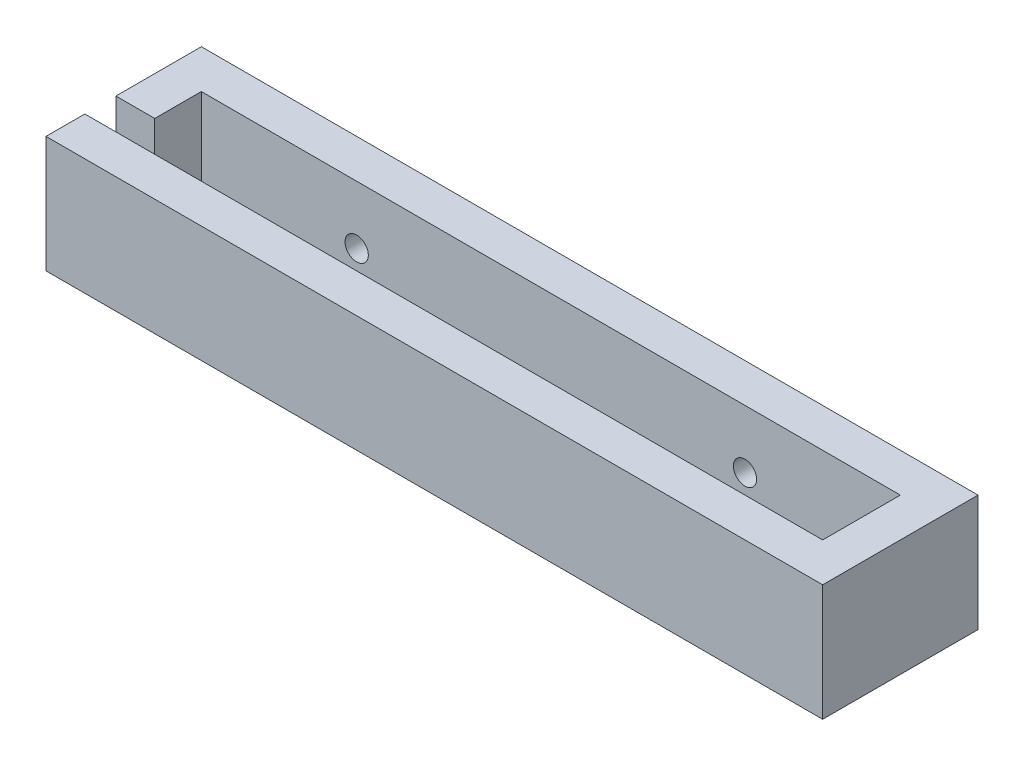
ISO-10303-21;
HEADER;
FILE_DESCRIPTION(('STEP AP214'),'2;1');
FILE_NAME('part.step','',(''),(''),'','','');
FILE_SCHEMA(('AUTOMOTIVE_DESIGN { 1 0 10303 214 1 1 1 1 }'));
ENDSEC;
DATA;
#1=APPLICATION_CONTEXT('core data for automotive mechanical design processes');
#2=APPLICATION_PROTOCOL_DEFINITION('international standard','automotive_design',2000,#1);
#3=PRODUCT_CONTEXT('',#1,'mechanical');
#4=PRODUCT('Part','Part','',(#3));
#5=PRODUCT_RELATED_PRODUCT_CATEGORY('part','',(#4));
#6=PRODUCT_DEFINITION_FORMATION('','',#4);
#7=PRODUCT_DEFINITION_CONTEXT('part definition',#1,'design');
#8=PRODUCT_DEFINITION('design','',#6,#7);
#9=PRODUCT_DEFINITION_SHAPE('','',#8);
#10=(LENGTH_UNIT() NAMED_UNIT(*) SI_UNIT(.MILLI.,.METRE.));
#11=(NAMED_UNIT(*) PLANE_ANGLE_UNIT() SI_UNIT($,.RADIAN.));
#12=(NAMED_UNIT(*) SI_UNIT($,.STERADIAN.) SOLID_ANGLE_UNIT());
#13=UNCERTAINTY_MEASURE_WITH_UNIT(LENGTH_MEASURE(1.E-05),#10,'distance_accuracy_value','');
#14=(GEOMETRIC_REPRESENTATION_CONTEXT(3) GLOBAL_UNCERTAINTY_ASSIGNED_CONTEXT((#13)) GLOBAL_UNIT_ASSIGNED_CONTEXT((#10,
#11,#12)) REPRESENTATION_CONTEXT('',''));
#15=CARTESIAN_POINT('',(0.,0.,0.));
#16=DIRECTION('',(0.,0.,1.));
#17=DIRECTION('',(1.,0.,0.));
#18=AXIS2_PLACEMENT_3D('',#15,#16,#17);
#19=CARTESIAN_POINT('',(-23.2792792792793,15.,-5.68018018018018));
#20=DIRECTION('',(1.,0.,0.));
#21=DIRECTION('',(0.,0.,-1.));
#22=AXIS2_PLACEMENT_3D('',#19,#20,#21);
#23=PLANE('',#22);
#24=DIRECTION('',(0.,0.,1.));
#25=VECTOR('',#24,1.);
#26=CARTESIAN_POINT('',(-23.2792792792793,15.,-5.68018018018018));
#27=LINE('',#26,#25);
#28=CARTESIAN_POINT('',(-23.2792792792793,15.,9.31981981981982));
#29=VERTEX_POINT('',#28);
#30=CARTESIAN_POINT('',(-23.2792792792793,15.,14.3198198198198));
#31=VERTEX_POINT('',#30);
#32=EDGE_CURVE('E80',#29,#31,#27,.T.);
#33=ORIENTED_EDGE('',*,*,#32,.F.);
#34=DIRECTION('',(0.,1.,0.));
#35=VECTOR('',#34,1.);
#36=CARTESIAN_POINT('',(-23.2792792792793,5.,9.31981981981982));
#37=LINE('',#36,#35);
#38=CARTESIAN_POINT('',(-23.2792792792793,5.,9.31981981981982));
#39=VERTEX_POINT('',#38);
#40=EDGE_CURVE('E161',#39,#29,#37,.T.);
#41=ORIENTED_EDGE('',*,*,#40,.F.);
#42=DIRECTION('',(0.,0.,1.));
#43=VECTOR('',#42,1.);
#44=CARTESIAN_POINT('',(-23.2792792792793,5.,9.31981981981982));
#45=LINE('',#44,#43);
#46=CARTESIAN_POINT('',(-23.2792792792793,5.,5.31981981981982));
#47=VERTEX_POINT('',#46);
#48=EDGE_CURVE('E129',#47,#39,#45,.T.);
#49=ORIENTED_EDGE('',*,*,#48,.F.);
#50=DIRECTION('',(0.,1.,0.));
#51=VECTOR('',#50,1.);
#52=CARTESIAN_POINT('',(-23.2792792792793,5.,5.31981981981982));
#53=LINE('',#52,#51);
#54=CARTESIAN_POINT('',(-23.2792792792793,15.,5.31981981981982));
#55=VERTEX_POINT('',#54);
#56=EDGE_CURVE('E124',#47,#55,#53,.T.);
#57=ORIENTED_EDGE('',*,*,#56,.T.);
#58=CARTESIAN_POINT('',(-23.2792792792793,15.,-5.68018018018018));
#59=VERTEX_POINT('',#58);
#60=EDGE_CURVE('E172',#59,#55,#27,.T.);
#61=ORIENTED_EDGE('',*,*,#60,.F.);
#62=DIRECTION('',(0.,-1.,0.));
#63=VECTOR('',#62,1.);
#64=CARTESIAN_POINT('',(-23.2792792792793,15.,-5.68018018018018));
#65=LINE('',#64,#63);
#66=CARTESIAN_POINT('',(-23.2792792792793,0.,-5.68018018018018));
#67=VERTEX_POINT('',#66);
#68=EDGE_CURVE('E179',#59,#67,#65,.T.);
#69=ORIENTED_EDGE('',*,*,#68,.T.);
#70=DIRECTION('',(0.,0.,1.));
#71=VECTOR('',#70,1.);
#72=CARTESIAN_POINT('',(-23.2792792792793,0.,-5.68018018018018));
#73=LINE('',#72,#71);
#74=CARTESIAN_POINT('',(-23.2792792792793,0.,14.3198198198198));
#75=VERTEX_POINT('',#74);
#76=EDGE_CURVE('E168',#67,#75,#73,.T.);
#77=ORIENTED_EDGE('',*,*,#76,.T.);
#78=DIRECTION('',(0.,-1.,0.));
#79=VECTOR('',#78,1.);
#80=CARTESIAN_POINT('',(-23.2792792792793,15.,14.3198198198198));
#81=LINE('',#80,#79);
#82=EDGE_CURVE('E11',#31,#75,#81,.T.);
#83=ORIENTED_EDGE('',*,*,#82,.F.);
#84=EDGE_LOOP('',(#33,#41,#49,#57,#61,#69,#77,#83));
#85=FACE_BOUND('',#84,.T.);
#86=ADVANCED_FACE('F33',(#85),#23,.F.);
#87=CARTESIAN_POINT('',(-23.2792792792793,15.,14.3198198198198));
#88=DIRECTION('',(0.,0.,-1.));
#89=DIRECTION('',(-1.,0.,0.));
#90=AXIS2_PLACEMENT_3D('',#87,#88,#89);
#91=PLANE('',#90);
#92=DIRECTION('',(1.,0.,0.));
#93=VECTOR('',#92,1.);
#94=CARTESIAN_POINT('',(-23.2792792792793,0.,14.3198198198198));
#95=LINE('',#94,#93);
#96=CARTESIAN_POINT('',(76.7207207207207,0.,14.3198198198198));
#97=VERTEX_POINT('',#96);
#98=EDGE_CURVE('E182',#75,#97,#95,.T.);
#99=ORIENTED_EDGE('',*,*,#98,.T.);
#100=DIRECTION('',(0.,-1.,0.));
#101=VECTOR('',#100,1.);
#102=CARTESIAN_POINT('',(76.7207207207207,15.,14.3198198198198));
#103=LINE('',#102,#101);
#104=CARTESIAN_POINT('',(76.7207207207207,15.,14.3198198198198));
#105=VERTEX_POINT('',#104);
#106=EDGE_CURVE('E41',#105,#97,#103,.T.);
#107=ORIENTED_EDGE('',*,*,#106,.F.);
#108=DIRECTION('',(1.,0.,0.));
#109=VECTOR('',#108,1.);
#110=CARTESIAN_POINT('',(-23.2792792792793,15.,14.3198198198198));
#111=LINE('',#110,#109);
#112=EDGE_CURVE('E174',#31,#105,#111,.T.);
#113=ORIENTED_EDGE('',*,*,#112,.F.);
#114=ORIENTED_EDGE('',*,*,#82,.T.);
#115=EDGE_LOOP('',(#99,#107,#113,#114));
#116=FACE_BOUND('',#115,.T.);
#117=ADVANCED_FACE('F210',(#116),#91,.F.);
#118=CARTESIAN_POINT('',(76.7207207207207,15.,-5.68018018018018));
#119=DIRECTION('',(-1.,0.,0.));
#120=DIRECTION('',(0.,0.,1.));
#121=AXIS2_PLACEMENT_3D('',#118,#119,#120);
#122=PLANE('',#121);
#123=DIRECTION('',(0.,0.,-1.));
#124=VECTOR('',#123,1.);
#125=CARTESIAN_POINT('',(76.7207207207207,0.,-5.68018018018018));
#126=LINE('',#125,#124);
#127=CARTESIAN_POINT('',(76.7207207207207,0.,-5.68018018018018));
#128=VERTEX_POINT('',#127);
#129=EDGE_CURVE('E67',#97,#128,#126,.T.);
#130=ORIENTED_EDGE('',*,*,#129,.T.);
#131=DIRECTION('',(0.,-1.,0.));
#132=VECTOR('',#131,1.);
#133=CARTESIAN_POINT('',(76.7207207207207,15.,-5.68018018018018));
#134=LINE('',#133,#132);
#135=CARTESIAN_POINT('',(76.7207207207207,15.,-5.68018018018018));
#136=VERTEX_POINT('',#135);
#137=EDGE_CURVE('E187',#136,#128,#134,.T.);
#138=ORIENTED_EDGE('',*,*,#137,.F.);
#139=DIRECTION('',(0.,0.,-1.));
#140=VECTOR('',#139,1.);
#141=CARTESIAN_POINT('',(76.7207207207207,15.,-5.68018018018018));
#142=LINE('',#141,#140);
#143=EDGE_CURVE('E176',#105,#136,#142,.T.);
#144=ORIENTED_EDGE('',*,*,#143,.F.);
#145=ORIENTED_EDGE('',*,*,#106,.T.);
#146=EDGE_LOOP('',(#130,#138,#144,#145));
#147=FACE_BOUND('',#146,.T.);
#148=ADVANCED_FACE('F190',(#147),#122,.F.);
#149=CARTESIAN_POINT('',(-23.2792792792793,15.,-5.68018018018018));
#150=DIRECTION('',(0.,0.,1.));
#151=DIRECTION('',(1.,0.,0.));
#152=AXIS2_PLACEMENT_3D('',#149,#150,#151);
#153=PLANE('',#152);
#154=CARTESIAN_POINT('',(1.72072072072074,7.5,-5.68018018018018));
#155=DIRECTION('',(0.,0.,-1.));
#156=DIRECTION('',(-1.,0.,0.));
#157=AXIS2_PLACEMENT_3D('',#154,#155,#156);
#158=CIRCLE('',#157,1.5);
#159=CARTESIAN_POINT('',(0.220720720720739,7.5,-5.68018018018018));
#160=VERTEX_POINT('',#159);
#161=EDGE_CURVE('E235',#160,#160,#158,.T.);
#162=ORIENTED_EDGE('',*,*,#161,.F.);
#163=EDGE_LOOP('',(#162));
#164=FACE_BOUND('',#163,.T.);
#165=CARTESIAN_POINT('',(51.7207207207207,7.5,-5.68018018018018));
#166=DIRECTION('',(0.,0.,-1.));
#167=DIRECTION('',(-1.,0.,0.));
#168=AXIS2_PLACEMENT_3D('',#165,#166,#167);
#169=CIRCLE('',#168,1.5);
#170=CARTESIAN_POINT('',(50.2207207207207,7.5,-5.68018018018018));
#171=VERTEX_POINT('',#170);
#172=EDGE_CURVE('E236',#171,#171,#169,.T.);
#173=ORIENTED_EDGE('',*,*,#172,.F.);
#174=EDGE_LOOP('',(#173));
#175=FACE_BOUND('',#174,.T.);
#176=DIRECTION('',(-1.,0.,0.));
#177=VECTOR('',#176,1.);
#178=CARTESIAN_POINT('',(-23.2792792792793,0.,-5.68018018018018));
#179=LINE('',#178,#177);
#180=EDGE_CURVE('E73',#128,#67,#179,.T.);
#181=ORIENTED_EDGE('',*,*,#180,.T.);
#182=ORIENTED_EDGE('',*,*,#68,.F.);
#183=DIRECTION('',(-1.,0.,0.));
#184=VECTOR('',#183,1.);
#185=CARTESIAN_POINT('',(-23.2792792792793,15.,-5.68018018018018));
#186=LINE('',#185,#184);
#187=EDGE_CURVE('E49',#136,#59,#186,.T.);
#188=ORIENTED_EDGE('',*,*,#187,.F.);
#189=ORIENTED_EDGE('',*,*,#137,.T.);
#190=EDGE_LOOP('',(#181,#182,#188,#189));
#191=FACE_BOUND('',#190,.T.);
#192=ADVANCED_FACE('F198',(#164,#175,#191),#153,.F.);
#193=CARTESIAN_POINT('',(0.,15.,0.));
#194=DIRECTION('',(0.,1.,0.));
#195=DIRECTION('',(0.,0.,1.));
#196=AXIS2_PLACEMENT_3D('',#193,#194,#195);
#197=PLANE('',#196);
#198=DIRECTION('',(1.,0.,0.));
#199=VECTOR('',#198,1.);
#200=CARTESIAN_POINT('',(-18.2792792792793,15.,9.31981981981982));
#201=LINE('',#200,#199);
#202=CARTESIAN_POINT('',(71.7207207207207,15.,9.31981981981982));
#203=VERTEX_POINT('',#202);
#204=EDGE_CURVE('E160',#29,#203,#201,.T.);
#205=ORIENTED_EDGE('',*,*,#204,.F.);
#206=ORIENTED_EDGE('',*,*,#32,.T.);
#207=ORIENTED_EDGE('',*,*,#112,.T.);
#208=ORIENTED_EDGE('',*,*,#143,.T.);
#209=ORIENTED_EDGE('',*,*,#187,.T.);
#210=ORIENTED_EDGE('',*,*,#60,.T.);
#211=DIRECTION('',(-1.,0.,0.));
#212=VECTOR('',#211,1.);
#213=CARTESIAN_POINT('',(-18.2792792792793,15.,5.31981981981982));
#214=LINE('',#213,#212);
#215=CARTESIAN_POINT('',(-18.2792792792793,15.,5.31981981981982));
#216=VERTEX_POINT('',#215);
#217=EDGE_CURVE('E130',#216,#55,#214,.T.);
#218=ORIENTED_EDGE('',*,*,#217,.F.);
#219=DIRECTION('',(0.,0.,1.));
#220=VECTOR('',#219,1.);
#221=CARTESIAN_POINT('',(-18.2792792792793,15.,-0.680180180180185));
#222=LINE('',#221,#220);
#223=CARTESIAN_POINT('',(-18.2792792792793,15.,-0.680180180180185));
#224=VERTEX_POINT('',#223);
#225=EDGE_CURVE('E139',#224,#216,#222,.T.);
#226=ORIENTED_EDGE('',*,*,#225,.F.);
#227=DIRECTION('',(-1.,0.,0.));
#228=VECTOR('',#227,1.);
#229=CARTESIAN_POINT('',(-18.2792792792793,15.,-0.680180180180185));
#230=LINE('',#229,#228);
#231=CARTESIAN_POINT('',(71.7207207207207,15.,-0.680180180180185));
#232=VERTEX_POINT('',#231);
#233=EDGE_CURVE('E146',#232,#224,#230,.T.);
#234=ORIENTED_EDGE('',*,*,#233,.F.);
#235=DIRECTION('',(0.,0.,-1.));
#236=VECTOR('',#235,1.);
#237=CARTESIAN_POINT('',(71.7207207207207,15.,-0.680180180180185));
#238=LINE('',#237,#236);
#239=EDGE_CURVE('E152',#203,#232,#238,.T.);
#240=ORIENTED_EDGE('',*,*,#239,.F.);
#241=EDGE_LOOP('',(#205,#206,#207,#208,#209,#210,#218,#226,#234,#240));
#242=FACE_BOUND('',#241,.T.);
#243=ADVANCED_FACE('F200',(#242),#197,.T.);
#244=CARTESIAN_POINT('',(0.,0.,0.));
#245=DIRECTION('',(0.,1.,0.));
#246=DIRECTION('',(0.,0.,1.));
#247=AXIS2_PLACEMENT_3D('',#244,#245,#246);
#248=PLANE('',#247);
#249=ORIENTED_EDGE('',*,*,#76,.F.);
#250=ORIENTED_EDGE('',*,*,#180,.F.);
#251=ORIENTED_EDGE('',*,*,#129,.F.);
#252=ORIENTED_EDGE('',*,*,#98,.F.);
#253=EDGE_LOOP('',(#249,#250,#251,#252));
#254=FACE_BOUND('',#253,.T.);
#255=ADVANCED_FACE('F194',(#254),#248,.F.);
#256=CARTESIAN_POINT('',(-18.2792792792793,5.,-0.680180180180185));
#257=DIRECTION('',(-1.,0.,0.));
#258=DIRECTION('',(0.,0.,1.));
#259=AXIS2_PLACEMENT_3D('',#256,#257,#258);
#260=PLANE('',#259);
#261=ORIENTED_EDGE('',*,*,#225,.T.);
#262=DIRECTION('',(0.,1.,0.));
#263=VECTOR('',#262,1.);
#264=CARTESIAN_POINT('',(-18.2792792792793,5.,5.31981981981982));
#265=LINE('',#264,#263);
#266=CARTESIAN_POINT('',(-18.2792792792793,5.,5.31981981981982));
#267=VERTEX_POINT('',#266);
#268=EDGE_CURVE('E121',#267,#216,#265,.T.);
#269=ORIENTED_EDGE('',*,*,#268,.F.);
#270=DIRECTION('',(0.,0.,1.));
#271=VECTOR('',#270,1.);
#272=CARTESIAN_POINT('',(-18.2792792792793,5.,-0.680180180180185));
#273=LINE('',#272,#271);
#274=CARTESIAN_POINT('',(-18.2792792792793,5.,-0.680180180180185));
#275=VERTEX_POINT('',#274);
#276=EDGE_CURVE('E136',#275,#267,#273,.T.);
#277=ORIENTED_EDGE('',*,*,#276,.F.);
#278=DIRECTION('',(0.,1.,0.));
#279=VECTOR('',#278,1.);
#280=CARTESIAN_POINT('',(-18.2792792792793,5.,-0.680180180180185));
#281=LINE('',#280,#279);
#282=EDGE_CURVE('E166',#275,#224,#281,.T.);
#283=ORIENTED_EDGE('',*,*,#282,.T.);
#284=EDGE_LOOP('',(#261,#269,#277,#283));
#285=FACE_BOUND('',#284,.T.);
#286=ADVANCED_FACE('F135',(#285),#260,.F.);
#287=CARTESIAN_POINT('',(-18.2792792792793,5.,-0.680180180180185));
#288=DIRECTION('',(0.,0.,-1.));
#289=DIRECTION('',(-1.,0.,0.));
#290=AXIS2_PLACEMENT_3D('',#287,#288,#289);
#291=PLANE('',#290);
#292=CARTESIAN_POINT('',(1.72072072072074,7.5,-0.680180180180184));
#293=DIRECTION('',(0.,0.,-1.));
#294=DIRECTION('',(-1.,0.,0.));
#295=AXIS2_PLACEMENT_3D('',#292,#293,#294);
#296=CIRCLE('',#295,1.5);
#297=CARTESIAN_POINT('',(0.220720720720739,7.5,-0.680180180180184));
#298=VERTEX_POINT('',#297);
#299=EDGE_CURVE('E230',#298,#298,#296,.F.);
#300=ORIENTED_EDGE('',*,*,#299,.F.);
#301=EDGE_LOOP('',(#300));
#302=FACE_BOUND('',#301,.T.);
#303=CARTESIAN_POINT('',(51.7207207207207,7.5,-0.680180180180184));
#304=DIRECTION('',(0.,0.,-1.));
#305=DIRECTION('',(-1.,0.,0.));
#306=AXIS2_PLACEMENT_3D('',#303,#304,#305);
#307=CIRCLE('',#306,1.5);
#308=CARTESIAN_POINT('',(50.2207207207207,7.5,-0.680180180180184));
#309=VERTEX_POINT('',#308);
#310=EDGE_CURVE('E232',#309,#309,#307,.F.);
#311=ORIENTED_EDGE('',*,*,#310,.F.);
#312=EDGE_LOOP('',(#311));
#313=FACE_BOUND('',#312,.T.);
#314=ORIENTED_EDGE('',*,*,#233,.T.);
#315=ORIENTED_EDGE('',*,*,#282,.F.);
#316=DIRECTION('',(-1.,0.,0.));
#317=VECTOR('',#316,1.);
#318=CARTESIAN_POINT('',(-18.2792792792793,5.,-0.680180180180185));
#319=LINE('',#318,#317);
#320=CARTESIAN_POINT('',(71.7207207207207,5.,-0.680180180180185));
#321=VERTEX_POINT('',#320);
#322=EDGE_CURVE('E144',#321,#275,#319,.T.);
#323=ORIENTED_EDGE('',*,*,#322,.F.);
#324=DIRECTION('',(0.,1.,0.));
#325=VECTOR('',#324,1.);
#326=CARTESIAN_POINT('',(71.7207207207207,5.,-0.680180180180185));
#327=LINE('',#326,#325);
#328=EDGE_CURVE('E169',#321,#232,#327,.T.);
#329=ORIENTED_EDGE('',*,*,#328,.T.);
#330=EDGE_LOOP('',(#314,#315,#323,#329));
#331=FACE_BOUND('',#330,.T.);
#332=ADVANCED_FACE('F250',(#302,#313,#331),#291,.F.);
#333=CARTESIAN_POINT('',(71.7207207207207,5.,-0.680180180180185));
#334=DIRECTION('',(1.,0.,0.));
#335=DIRECTION('',(0.,0.,-1.));
#336=AXIS2_PLACEMENT_3D('',#333,#334,#335);
#337=PLANE('',#336);
#338=ORIENTED_EDGE('',*,*,#239,.T.);
#339=ORIENTED_EDGE('',*,*,#328,.F.);
#340=DIRECTION('',(0.,0.,-1.));
#341=VECTOR('',#340,1.);
#342=CARTESIAN_POINT('',(71.7207207207207,5.,-0.680180180180185));
#343=LINE('',#342,#341);
#344=CARTESIAN_POINT('',(71.7207207207207,5.,9.31981981981982));
#345=VERTEX_POINT('',#344);
#346=EDGE_CURVE('E149',#345,#321,#343,.T.);
#347=ORIENTED_EDGE('',*,*,#346,.F.);
#348=DIRECTION('',(0.,1.,0.));
#349=VECTOR('',#348,1.);
#350=CARTESIAN_POINT('',(71.7207207207207,5.,9.31981981981982));
#351=LINE('',#350,#349);
#352=EDGE_CURVE('E158',#345,#203,#351,.T.);
#353=ORIENTED_EDGE('',*,*,#352,.T.);
#354=EDGE_LOOP('',(#338,#339,#347,#353));
#355=FACE_BOUND('',#354,.T.);
#356=ADVANCED_FACE('F252',(#355),#337,.F.);
#357=CARTESIAN_POINT('',(-18.2792792792793,5.,9.31981981981982));
#358=DIRECTION('',(0.,0.,1.));
#359=DIRECTION('',(1.,0.,0.));
#360=AXIS2_PLACEMENT_3D('',#357,#358,#359);
#361=PLANE('',#360);
#362=ORIENTED_EDGE('',*,*,#204,.T.);
#363=ORIENTED_EDGE('',*,*,#352,.F.);
#364=DIRECTION('',(1.,0.,0.));
#365=VECTOR('',#364,1.);
#366=CARTESIAN_POINT('',(-18.2792792792793,5.,9.31981981981982));
#367=LINE('',#366,#365);
#368=EDGE_CURVE('E145',#39,#345,#367,.T.);
#369=ORIENTED_EDGE('',*,*,#368,.F.);
#370=ORIENTED_EDGE('',*,*,#40,.T.);
#371=EDGE_LOOP('',(#362,#363,#369,#370));
#372=FACE_BOUND('',#371,.T.);
#373=ADVANCED_FACE('F226',(#372),#361,.F.);
#374=CARTESIAN_POINT('',(0.,5.,0.));
#375=DIRECTION('',(0.,1.,0.));
#376=DIRECTION('',(0.,0.,1.));
#377=AXIS2_PLACEMENT_3D('',#374,#375,#376);
#378=PLANE('',#377);
#379=ORIENTED_EDGE('',*,*,#276,.T.);
#380=DIRECTION('',(-1.,0.,0.));
#381=VECTOR('',#380,1.);
#382=CARTESIAN_POINT('',(-18.2792792792793,5.,5.31981981981982));
#383=LINE('',#382,#381);
#384=EDGE_CURVE('E118',#267,#47,#383,.T.);
#385=ORIENTED_EDGE('',*,*,#384,.T.);
#386=ORIENTED_EDGE('',*,*,#48,.T.);
#387=ORIENTED_EDGE('',*,*,#368,.T.);
#388=ORIENTED_EDGE('',*,*,#346,.T.);
#389=ORIENTED_EDGE('',*,*,#322,.T.);
#390=EDGE_LOOP('',(#379,#385,#386,#387,#388,#389));
#391=FACE_BOUND('',#390,.T.);
#392=ADVANCED_FACE('F141',(#391),#378,.T.);
#393=CARTESIAN_POINT('',(-18.2792792792793,5.,5.31981981981982));
#394=DIRECTION('',(0.,0.,-1.));
#395=DIRECTION('',(-1.,0.,0.));
#396=AXIS2_PLACEMENT_3D('',#393,#394,#395);
#397=PLANE('',#396);
#398=ORIENTED_EDGE('',*,*,#217,.T.);
#399=ORIENTED_EDGE('',*,*,#56,.F.);
#400=ORIENTED_EDGE('',*,*,#384,.F.);
#401=ORIENTED_EDGE('',*,*,#268,.T.);
#402=EDGE_LOOP('',(#398,#399,#400,#401));
#403=FACE_BOUND('',#402,.T.);
#404=ADVANCED_FACE('F120',(#403),#397,.F.);
#405=CARTESIAN_POINT('',(51.7207207207207,7.5,14.3208198198198));
#406=DIRECTION('',(0.,0.,-1.));
#407=DIRECTION('',(-1.,0.,0.));
#408=AXIS2_PLACEMENT_3D('',#405,#406,#407);
#409=CYLINDRICAL_SURFACE('',#408,1.5);
#410=ORIENTED_EDGE('',*,*,#172,.T.);
#411=EDGE_LOOP('',(#410));
#412=FACE_BOUND('',#411,.T.);
#413=ORIENTED_EDGE('',*,*,#310,.T.);
#414=EDGE_LOOP('',(#413));
#415=FACE_BOUND('',#414,.T.);
#416=ADVANCED_FACE('F246',(#412,#415),#409,.F.);
#417=CARTESIAN_POINT('',(1.72072072072074,7.5,14.3208198198198));
#418=DIRECTION('',(0.,0.,-1.));
#419=DIRECTION('',(-1.,0.,0.));
#420=AXIS2_PLACEMENT_3D('',#417,#418,#419);
#421=CYLINDRICAL_SURFACE('',#420,1.5);
#422=ORIENTED_EDGE('',*,*,#161,.T.);
#423=EDGE_LOOP('',(#422));
#424=FACE_BOUND('',#423,.T.);
#425=ORIENTED_EDGE('',*,*,#299,.T.);
#426=EDGE_LOOP('',(#425));
#427=FACE_BOUND('',#426,.T.);
#428=ADVANCED_FACE('F243',(#424,#427),#421,.F.);
#429=CLOSED_SHELL('',(#86,#117,#148,#192,#243,#255,#286,#332,#356,#373,#392,#404,#416,#428));
#430=MANIFOLD_SOLID_BREP('B2',#429);
#431=ADVANCED_BREP_SHAPE_REPRESENTATION('',(#18,#430),#14);
#432=SHAPE_DEFINITION_REPRESENTATION(#9,#431);
ENDSEC;
END-ISO-10303-21;
